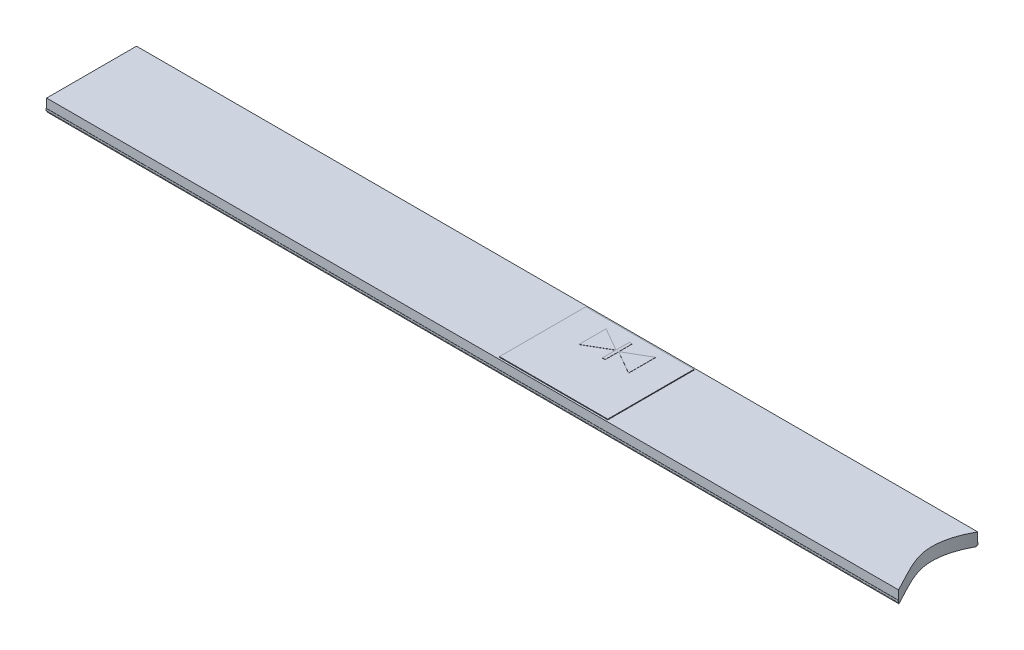
ISO-10303-21;
HEADER;
FILE_DESCRIPTION(('STEP AP214'),'2;1');
FILE_NAME('part.step','',(''),(''),'','','');
FILE_SCHEMA(('AUTOMOTIVE_DESIGN { 1 0 10303 214 1 1 1 1 }'));
ENDSEC;
DATA;
#1=APPLICATION_CONTEXT('core data for automotive mechanical design processes');
#2=APPLICATION_PROTOCOL_DEFINITION('international standard','automotive_design',2000,#1);
#3=PRODUCT_CONTEXT('',#1,'mechanical');
#4=PRODUCT('Part','Part','',(#3));
#5=PRODUCT_RELATED_PRODUCT_CATEGORY('part','',(#4));
#6=PRODUCT_DEFINITION_FORMATION('','',#4);
#7=PRODUCT_DEFINITION_CONTEXT('part definition',#1,'design');
#8=PRODUCT_DEFINITION('design','',#6,#7);
#9=PRODUCT_DEFINITION_SHAPE('','',#8);
#10=(LENGTH_UNIT() NAMED_UNIT(*) SI_UNIT(.MILLI.,.METRE.));
#11=(NAMED_UNIT(*) PLANE_ANGLE_UNIT() SI_UNIT($,.RADIAN.));
#12=(NAMED_UNIT(*) SI_UNIT($,.STERADIAN.) SOLID_ANGLE_UNIT());
#13=UNCERTAINTY_MEASURE_WITH_UNIT(LENGTH_MEASURE(1.E-05),#10,'distance_accuracy_value','');
#14=(GEOMETRIC_REPRESENTATION_CONTEXT(3) GLOBAL_UNCERTAINTY_ASSIGNED_CONTEXT((#13)) GLOBAL_UNIT_ASSIGNED_CONTEXT((#10,
#11,#12)) REPRESENTATION_CONTEXT('',''));
#15=CARTESIAN_POINT('',(0.,0.,0.));
#16=DIRECTION('',(0.,0.,1.));
#17=DIRECTION('',(1.,0.,0.));
#18=AXIS2_PLACEMENT_3D('',#15,#16,#17);
#19=CARTESIAN_POINT('',(50.05,1.38,-0.220000006957639));
#20=DIRECTION('',(0.,1.,0.));
#21=DIRECTION('',(0.,0.,1.));
#22=AXIS2_PLACEMENT_3D('',#19,#20,#21);
#23=PLANE('',#22);
#24=DIRECTION('',(0.,0.,1.));
#25=VECTOR('',#24,1.);
#26=CARTESIAN_POINT('',(50.05,1.38,-9.78000000000886));
#27=LINE('',#26,#25);
#28=CARTESIAN_POINT('',(50.05,1.38,-9.78000000000886));
#29=VERTEX_POINT('',#28);
#30=CARTESIAN_POINT('',(50.05,1.38,-0.220000006957639));
#31=VERTEX_POINT('',#30);
#32=EDGE_CURVE('E272',#29,#31,#27,.T.);
#33=ORIENTED_EDGE('',*,*,#32,.T.);
#34=DIRECTION('',(1.,0.,0.));
#35=VECTOR('',#34,1.);
#36=CARTESIAN_POINT('',(50.05,1.38,-0.220000006957639));
#37=LINE('',#36,#35);
#38=CARTESIAN_POINT('',(62.05,1.38,-0.220000006957639));
#39=VERTEX_POINT('',#38);
#40=EDGE_CURVE('E276',#31,#39,#37,.T.);
#41=ORIENTED_EDGE('',*,*,#40,.T.);
#42=DIRECTION('',(0.,0.,-1.));
#43=VECTOR('',#42,1.);
#44=CARTESIAN_POINT('',(62.05,1.38,-9.78000000000886));
#45=LINE('',#44,#43);
#46=CARTESIAN_POINT('',(62.05,1.38,-9.78000000000886));
#47=VERTEX_POINT('',#46);
#48=EDGE_CURVE('E280',#39,#47,#45,.T.);
#49=ORIENTED_EDGE('',*,*,#48,.T.);
#50=DIRECTION('',(-1.,0.,0.));
#51=VECTOR('',#50,1.);
#52=CARTESIAN_POINT('',(50.05,1.38,-9.78000000000886));
#53=LINE('',#52,#51);
#54=EDGE_CURVE('E283',#47,#29,#53,.T.);
#55=ORIENTED_EDGE('',*,*,#54,.T.);
#56=EDGE_LOOP('',(#33,#41,#49,#55));
#57=FACE_BOUND('',#56,.T.);
#58=DIRECTION('',(-0.866025403784439,0.,-0.5));
#59=VECTOR('',#58,1.);
#60=CARTESIAN_POINT('',(55.9,1.38,-7.28118403431081));
#61=LINE('',#60,#59);
#62=CARTESIAN_POINT('',(55.9,1.38,-7.28118403431081));
#63=VERTEX_POINT('',#62);
#64=CARTESIAN_POINT('',(53.3039745962156,1.38,-8.78000000000886));
#65=VERTEX_POINT('',#64);
#66=EDGE_CURVE('E722',#63,#65,#61,.T.);
#67=ORIENTED_EDGE('',*,*,#66,.F.);
#68=DIRECTION('',(0.,0.,1.));
#69=VECTOR('',#68,1.);
#70=CARTESIAN_POINT('',(55.9,1.38,-8.78000000000886));
#71=LINE('',#70,#69);
#72=CARTESIAN_POINT('',(55.9,1.38,-8.78000000000886));
#73=VERTEX_POINT('',#72);
#74=EDGE_CURVE('E257',#73,#63,#71,.T.);
#75=ORIENTED_EDGE('',*,*,#74,.F.);
#76=DIRECTION('',(-1.,0.,0.));
#77=VECTOR('',#76,1.);
#78=CARTESIAN_POINT('',(55.9,1.38,-8.78000000000886));
#79=LINE('',#78,#77);
#80=CARTESIAN_POINT('',(56.2,1.38,-8.78000000000886));
#81=VERTEX_POINT('',#80);
#82=EDGE_CURVE('E253',#81,#73,#79,.T.);
#83=ORIENTED_EDGE('',*,*,#82,.F.);
#84=DIRECTION('',(0.,0.,-1.));
#85=VECTOR('',#84,1.);
#86=CARTESIAN_POINT('',(56.2,1.38,-8.78000000000886));
#87=LINE('',#86,#85);
#88=CARTESIAN_POINT('',(56.2,1.38,-7.28118403431081));
#89=VERTEX_POINT('',#88);
#90=EDGE_CURVE('E717',#89,#81,#87,.T.);
#91=ORIENTED_EDGE('',*,*,#90,.F.);
#92=DIRECTION('',(-0.866025403784439,0.,0.5));
#93=VECTOR('',#92,1.);
#94=CARTESIAN_POINT('',(56.2,1.38,-7.28118403431081));
#95=LINE('',#94,#93);
#96=CARTESIAN_POINT('',(58.7960254037844,1.38,-8.78000000000886));
#97=VERTEX_POINT('',#96);
#98=EDGE_CURVE('E751',#97,#89,#95,.T.);
#99=ORIENTED_EDGE('',*,*,#98,.F.);
#100=DIRECTION('',(0.,0.,-1.));
#101=VECTOR('',#100,1.);
#102=CARTESIAN_POINT('',(58.7960254037844,1.38,-8.78000000000886));
#103=LINE('',#102,#101);
#104=CARTESIAN_POINT('',(58.7960254037844,1.38,-5.78000000000886));
#105=VERTEX_POINT('',#104);
#106=EDGE_CURVE('E748',#105,#97,#103,.T.);
#107=ORIENTED_EDGE('',*,*,#106,.F.);
#108=DIRECTION('',(0.866025403784439,0.,0.5));
#109=VECTOR('',#108,1.);
#110=CARTESIAN_POINT('',(58.7960254037844,1.38,-5.78000000000886));
#111=LINE('',#110,#109);
#112=CARTESIAN_POINT('',(56.2,1.38,-7.27881596570691));
#113=VERTEX_POINT('',#112);
#114=EDGE_CURVE('E745',#113,#105,#111,.T.);
#115=ORIENTED_EDGE('',*,*,#114,.F.);
#116=DIRECTION('',(0.,0.,-1.));
#117=VECTOR('',#116,1.);
#118=CARTESIAN_POINT('',(56.2,1.38,-7.27881596570691));
#119=LINE('',#118,#117);
#120=CARTESIAN_POINT('',(56.2,1.38,-5.78000000000886));
#121=VERTEX_POINT('',#120);
#122=EDGE_CURVE('E742',#121,#113,#119,.T.);
#123=ORIENTED_EDGE('',*,*,#122,.F.);
#124=DIRECTION('',(1.,0.,0.));
#125=VECTOR('',#124,1.);
#126=CARTESIAN_POINT('',(55.9,1.38,-5.78000000000886));
#127=LINE('',#126,#125);
#128=CARTESIAN_POINT('',(55.9,1.38,-5.78000000000886));
#129=VERTEX_POINT('',#128);
#130=EDGE_CURVE('E739',#129,#121,#127,.T.);
#131=ORIENTED_EDGE('',*,*,#130,.F.);
#132=DIRECTION('',(0.,0.,1.));
#133=VECTOR('',#132,1.);
#134=CARTESIAN_POINT('',(55.9,1.38,-7.27881596570692));
#135=LINE('',#134,#133);
#136=CARTESIAN_POINT('',(55.9,1.38,-7.27881596570692));
#137=VERTEX_POINT('',#136);
#138=EDGE_CURVE('E736',#137,#129,#135,.T.);
#139=ORIENTED_EDGE('',*,*,#138,.F.);
#140=DIRECTION('',(0.866025403784438,0.,-0.5));
#141=VECTOR('',#140,1.);
#142=CARTESIAN_POINT('',(53.3039745962156,1.38,-5.78000000000886));
#143=LINE('',#142,#141);
#144=CARTESIAN_POINT('',(53.3039745962156,1.38,-5.78000000000886));
#145=VERTEX_POINT('',#144);
#146=EDGE_CURVE('E733',#145,#137,#143,.T.);
#147=ORIENTED_EDGE('',*,*,#146,.F.);
#148=DIRECTION('',(0.,0.,1.));
#149=VECTOR('',#148,1.);
#150=CARTESIAN_POINT('',(53.3039745962156,1.38,-8.78000000000886));
#151=LINE('',#150,#149);
#152=EDGE_CURVE('E726',#65,#145,#151,.T.);
#153=ORIENTED_EDGE('',*,*,#152,.F.);
#154=EDGE_LOOP('',(#67,#75,#83,#91,#99,#107,#115,#123,#131,#139,#147,#153));
#155=FACE_BOUND('',#154,.T.);
#156=ADVANCED_FACE('F35',(#57,#155),#23,.T.);
#157=CARTESIAN_POINT('',(100.,1.3,-0.02));
#158=DIRECTION('',(0.,-1.,0.));
#159=DIRECTION('',(0.,0.,-1.));
#160=AXIS2_PLACEMENT_3D('',#157,#158,#159);
#161=PLANE('',#160);
#162=DIRECTION('',(-1.,0.,0.));
#163=VECTOR('',#162,1.);
#164=CARTESIAN_POINT('',(100.,1.3,-0.02));
#165=LINE('',#164,#163);
#166=CARTESIAN_POINT('',(94.4813840286868,1.3,-0.0200000069576393));
#167=VERTEX_POINT('',#166);
#168=CARTESIAN_POINT('',(0.05,1.3,-0.02));
#169=VERTEX_POINT('',#168);
#170=EDGE_CURVE('E945',#167,#169,#165,.T.);
#171=ORIENTED_EDGE('',*,*,#170,.F.);
#172=CARTESIAN_POINT('',(106.958570584329,1.3,-17.1821009492431));
#173=CARTESIAN_POINT('',(100.083371055669,1.3,-18.5938583080374));
#174=CARTESIAN_POINT('',(87.5504685425177,1.3,-7.82181495656971));
#175=CARTESIAN_POINT('',(98.8594167359777,1.3,3.79082974327303));
#176=CARTESIAN_POINT('',(86.8974112804466,1.3,25.6367125442653));
#177=CARTESIAN_POINT('',(120.943228088424,1.3,13.4277186627103));
#178=CARTESIAN_POINT('',(109.774353112615,1.3,0.100316480868152));
#179=CARTESIAN_POINT('',(117.385402067769,1.3,-8.88298668915562));
#180=CARTESIAN_POINT('',(111.370581590185,1.3,-16.2761361145304));
#181=CARTESIAN_POINT('',(106.958570584329,1.3,-17.1821009492431));
#182=B_SPLINE_CURVE_WITH_KNOTS('',3,(#172,#173,#174,#175,#176,#177,#178,#179,#180,#181),
.UNSPECIFIED.,.T.,.F.,(4,1,1,1,1,1,1,4),(0.,0.200977252608359,0.292151963918186,
0.455467007185675,0.683077899943606,0.789929557939063,0.871027183031058,1.),.UNSPECIFIED.);
#183=CARTESIAN_POINT('',(93.2974374688703,1.3,-9.98000000000886));
#184=VERTEX_POINT('',#183);
#185=EDGE_CURVE('E310',#184,#167,#182,.T.);
#186=ORIENTED_EDGE('',*,*,#185,.F.);
#187=DIRECTION('',(-1.,0.,0.));
#188=VECTOR('',#187,1.);
#189=CARTESIAN_POINT('',(100.,1.3,-9.98));
#190=LINE('',#189,#188);
#191=CARTESIAN_POINT('',(0.05,1.3,-9.98));
#192=VERTEX_POINT('',#191);
#193=EDGE_CURVE('E948',#184,#192,#190,.T.);
#194=ORIENTED_EDGE('',*,*,#193,.T.);
#195=DIRECTION('',(0.,0.,1.));
#196=VECTOR('',#195,1.);
#197=CARTESIAN_POINT('',(0.05,1.3,-0.02));
#198=LINE('',#197,#196);
#199=EDGE_CURVE('E880',#192,#169,#198,.T.);
#200=ORIENTED_EDGE('',*,*,#199,.T.);
#201=EDGE_LOOP('',(#171,#186,#194,#200));
#202=FACE_BOUND('',#201,.T.);
#203=DIRECTION('',(0.,0.,1.));
#204=VECTOR('',#203,1.);
#205=CARTESIAN_POINT('',(50.05,1.3,-9.78000000000886));
#206=LINE('',#205,#204);
#207=CARTESIAN_POINT('',(50.05,1.3,-9.78000000000886));
#208=VERTEX_POINT('',#207);
#209=CARTESIAN_POINT('',(50.05,1.3,-0.220000006957639));
#210=VERTEX_POINT('',#209);
#211=EDGE_CURVE('E260',#208,#210,#206,.T.);
#212=ORIENTED_EDGE('',*,*,#211,.F.);
#213=DIRECTION('',(-1.,0.,0.));
#214=VECTOR('',#213,1.);
#215=CARTESIAN_POINT('',(50.05,1.3,-9.78000000000886));
#216=LINE('',#215,#214);
#217=CARTESIAN_POINT('',(62.05,1.3,-9.78000000000886));
#218=VERTEX_POINT('',#217);
#219=EDGE_CURVE('E277',#218,#208,#216,.T.);
#220=ORIENTED_EDGE('',*,*,#219,.F.);
#221=DIRECTION('',(0.,0.,-1.));
#222=VECTOR('',#221,1.);
#223=CARTESIAN_POINT('',(62.05,1.3,-9.78000000000886));
#224=LINE('',#223,#222);
#225=CARTESIAN_POINT('',(62.05,1.3,-0.220000006957639));
#226=VERTEX_POINT('',#225);
#227=EDGE_CURVE('E289',#226,#218,#224,.T.);
#228=ORIENTED_EDGE('',*,*,#227,.F.);
#229=DIRECTION('',(1.,0.,0.));
#230=VECTOR('',#229,1.);
#231=CARTESIAN_POINT('',(50.05,1.3,-0.220000006957639));
#232=LINE('',#231,#230);
#233=EDGE_CURVE('E64',#210,#226,#232,.T.);
#234=ORIENTED_EDGE('',*,*,#233,.F.);
#235=EDGE_LOOP('',(#212,#220,#228,#234));
#236=FACE_BOUND('',#235,.T.);
#237=ADVANCED_FACE('F367',(#202,#236),#161,.F.);
#238=CARTESIAN_POINT('',(0.,0.1,-0.1));
#239=DIRECTION('',(1.,0.,0.));
#240=DIRECTION('',(0.,0.,-1.));
#241=AXIS2_PLACEMENT_3D('',#238,#239,#240);
#242=PLANE('',#241);
#243=DIRECTION('',(0.,0.,1.));
#244=VECTOR('',#243,1.);
#245=CARTESIAN_POINT('',(0.,0.,-9.9));
#246=LINE('',#245,#244);
#247=CARTESIAN_POINT('',(0.,0.,-9.9));
#248=VERTEX_POINT('',#247);
#249=CARTESIAN_POINT('',(0.,0.,-0.100000000000001));
#250=VERTEX_POINT('',#249);
#251=EDGE_CURVE('E826',#248,#250,#246,.T.);
#252=ORIENTED_EDGE('',*,*,#251,.T.);
#253=CARTESIAN_POINT('',(0.,0.1,-0.1));
#254=DIRECTION('',(1.,0.,0.));
#255=DIRECTION('',(0.,0.,-1.));
#256=AXIS2_PLACEMENT_3D('',#253,#254,#255);
#257=CIRCLE('',#256,0.1);
#258=CARTESIAN_POINT('',(0.,0.100000000000001,0.));
#259=VERTEX_POINT('',#258);
#260=EDGE_CURVE('E841',#259,#250,#257,.T.);
#261=ORIENTED_EDGE('',*,*,#260,.F.);
#262=DIRECTION('',(0.,-1.,0.));
#263=VECTOR('',#262,1.);
#264=CARTESIAN_POINT('',(0.,0.100000000000001,0.));
#265=LINE('',#264,#263);
#266=CARTESIAN_POINT('',(0.,0.3,0.));
#267=VERTEX_POINT('',#266);
#268=EDGE_CURVE('E923',#267,#259,#265,.T.);
#269=ORIENTED_EDGE('',*,*,#268,.F.);
#270=DIRECTION('',(0.,0.,1.));
#271=VECTOR('',#270,1.);
#272=CARTESIAN_POINT('',(0.,0.3,0.));
#273=LINE('',#272,#271);
#274=CARTESIAN_POINT('',(0.,0.3,-10.));
#275=VERTEX_POINT('',#274);
#276=EDGE_CURVE('E919',#275,#267,#273,.T.);
#277=ORIENTED_EDGE('',*,*,#276,.F.);
#278=DIRECTION('',(0.,1.,0.));
#279=VECTOR('',#278,1.);
#280=CARTESIAN_POINT('',(0.,0.100000000000001,-10.));
#281=LINE('',#280,#279);
#282=CARTESIAN_POINT('',(0.,0.100000000000001,-10.));
#283=VERTEX_POINT('',#282);
#284=EDGE_CURVE('E882',#283,#275,#281,.T.);
#285=ORIENTED_EDGE('',*,*,#284,.F.);
#286=CARTESIAN_POINT('',(0.,0.1,-9.9));
#287=DIRECTION('',(1.,0.,0.));
#288=DIRECTION('',(0.,0.,1.));
#289=AXIS2_PLACEMENT_3D('',#286,#287,#288);
#290=CIRCLE('',#289,0.0999999999999997);
#291=EDGE_CURVE('E838',#248,#283,#290,.T.);
#292=ORIENTED_EDGE('',*,*,#291,.F.);
#293=EDGE_LOOP('',(#252,#261,#269,#277,#285,#292));
#294=FACE_BOUND('',#293,.T.);
#295=ADVANCED_FACE('F369',(#294),#242,.F.);
#296=CARTESIAN_POINT('',(100.,0.3,-9.98));
#297=DIRECTION('',(0.,0.,1.));
#298=DIRECTION('',(1.,0.,0.));
#299=AXIS2_PLACEMENT_3D('',#296,#297,#298);
#300=PLANE('',#299);
#301=ORIENTED_EDGE('',*,*,#193,.F.);
#302=DIRECTION('',(0.,1.,0.));
#303=VECTOR('',#302,1.);
#304=CARTESIAN_POINT('',(93.2974374688653,-0.7,-9.98));
#305=LINE('',#304,#303);
#306=CARTESIAN_POINT('',(93.2974374688703,0.3,-9.98000000000885));
#307=VERTEX_POINT('',#306);
#308=EDGE_CURVE('E829',#184,#307,#305,.F.);
#309=ORIENTED_EDGE('',*,*,#308,.T.);
#310=DIRECTION('',(-1.,0.,0.));
#311=VECTOR('',#310,1.);
#312=CARTESIAN_POINT('',(100.,0.3,-9.98));
#313=LINE('',#312,#311);
#314=CARTESIAN_POINT('',(0.05,0.3,-9.98));
#315=VERTEX_POINT('',#314);
#316=EDGE_CURVE('E951',#307,#315,#313,.T.);
#317=ORIENTED_EDGE('',*,*,#316,.T.);
#318=DIRECTION('',(0.,1.,0.));
#319=VECTOR('',#318,1.);
#320=CARTESIAN_POINT('',(0.05,0.3,-9.98));
#321=LINE('',#320,#319);
#322=EDGE_CURVE('E872',#315,#192,#321,.T.);
#323=ORIENTED_EDGE('',*,*,#322,.T.);
#324=EDGE_LOOP('',(#301,#309,#317,#323));
#325=FACE_BOUND('',#324,.T.);
#326=ADVANCED_FACE('F365',(#325),#300,.F.);
#327=CARTESIAN_POINT('',(100.,0.3,-0.02));
#328=DIRECTION('',(0.,0.,-1.));
#329=DIRECTION('',(0.,1.,0.));
#330=AXIS2_PLACEMENT_3D('',#327,#328,#329);
#331=PLANE('',#330);
#332=DIRECTION('',(-1.,0.,0.));
#333=VECTOR('',#332,1.);
#334=CARTESIAN_POINT('',(100.,0.3,-0.02));
#335=LINE('',#334,#333);
#336=CARTESIAN_POINT('',(94.4813840286868,0.3,-0.0200000069576393));
#337=VERTEX_POINT('',#336);
#338=CARTESIAN_POINT('',(0.05,0.3,-0.02));
#339=VERTEX_POINT('',#338);
#340=EDGE_CURVE('E942',#337,#339,#335,.T.);
#341=ORIENTED_EDGE('',*,*,#340,.F.);
#342=DIRECTION('',(0.,1.,0.));
#343=VECTOR('',#342,1.);
#344=CARTESIAN_POINT('',(94.4813840321051,-0.7,-0.019999999999999));
#345=LINE('',#344,#343);
#346=EDGE_CURVE('E859',#337,#167,#345,.T.);
#347=ORIENTED_EDGE('',*,*,#346,.T.);
#348=ORIENTED_EDGE('',*,*,#170,.T.);
#349=DIRECTION('',(0.,-1.,0.));
#350=VECTOR('',#349,1.);
#351=CARTESIAN_POINT('',(0.05,0.3,-0.02));
#352=LINE('',#351,#350);
#353=EDGE_CURVE('E847',#169,#339,#352,.T.);
#354=ORIENTED_EDGE('',*,*,#353,.T.);
#355=EDGE_LOOP('',(#341,#347,#348,#354));
#356=FACE_BOUND('',#355,.T.);
#357=ADVANCED_FACE('F362',(#356),#331,.F.);
#358=CARTESIAN_POINT('',(100.,0.100000000000001,-10.));
#359=DIRECTION('',(0.,0.,1.));
#360=DIRECTION('',(1.,0.,0.));
#361=AXIS2_PLACEMENT_3D('',#358,#359,#360);
#362=PLANE('',#361);
#363=DIRECTION('',(-1.,0.,0.));
#364=VECTOR('',#363,1.);
#365=CARTESIAN_POINT('',(100.,0.3,-10.));
#366=LINE('',#365,#364);
#367=CARTESIAN_POINT('',(93.3086581902393,0.3,-10.));
#368=VERTEX_POINT('',#367);
#369=EDGE_CURVE('E49',#368,#275,#366,.T.);
#370=ORIENTED_EDGE('',*,*,#369,.F.);
#371=DIRECTION('',(0.,1.,0.));
#372=VECTOR('',#371,1.);
#373=CARTESIAN_POINT('',(93.3086581902393,-0.7,-10.));
#374=LINE('',#373,#372);
#375=CARTESIAN_POINT('',(93.3086581902393,0.100000000000001,-10.));
#376=VERTEX_POINT('',#375);
#377=EDGE_CURVE('E856',#368,#376,#374,.F.);
#378=ORIENTED_EDGE('',*,*,#377,.T.);
#379=DIRECTION('',(-1.,0.,0.));
#380=VECTOR('',#379,1.);
#381=CARTESIAN_POINT('',(100.,0.100000000000001,-10.));
#382=LINE('',#381,#380);
#383=EDGE_CURVE('E840',#376,#283,#382,.T.);
#384=ORIENTED_EDGE('',*,*,#383,.T.);
#385=ORIENTED_EDGE('',*,*,#284,.T.);
#386=EDGE_LOOP('',(#370,#378,#384,#385));
#387=FACE_BOUND('',#386,.T.);
#388=ADVANCED_FACE('F37',(#387),#362,.F.);
#389=CARTESIAN_POINT('',(100.,0.3,0.));
#390=DIRECTION('',(0.,-1.,0.));
#391=DIRECTION('',(0.,0.,-1.));
#392=AXIS2_PLACEMENT_3D('',#389,#390,#391);
#393=PLANE('',#392);
#394=DIRECTION('',(-1.,0.,0.));
#395=VECTOR('',#394,1.);
#396=CARTESIAN_POINT('',(100.,0.3,0.));
#397=LINE('',#396,#395);
#398=CARTESIAN_POINT('',(94.4911971587422,0.3,0.));
#399=VERTEX_POINT('',#398);
#400=EDGE_CURVE('E939',#399,#267,#397,.T.);
#401=ORIENTED_EDGE('',*,*,#400,.F.);
#402=CARTESIAN_POINT('',(106.958570584329,0.3,-17.1821009492431));
#403=CARTESIAN_POINT('',(100.083371055669,0.3,-18.5938583080374));
#404=CARTESIAN_POINT('',(87.5504685425177,0.3,-7.82181495656971));
#405=CARTESIAN_POINT('',(98.8594167359777,0.3,3.79082974327303));
#406=CARTESIAN_POINT('',(86.8974112804466,0.3,25.6367125442653));
#407=CARTESIAN_POINT('',(120.943228088424,0.3,13.4277186627103));
#408=CARTESIAN_POINT('',(109.774353112615,0.3,0.100316480868152));
#409=CARTESIAN_POINT('',(117.385402067769,0.3,-8.88298668915562));
#410=CARTESIAN_POINT('',(111.370581590185,0.3,-16.2761361145304));
#411=CARTESIAN_POINT('',(106.958570584329,0.3,-17.1821009492431));
#412=B_SPLINE_CURVE_WITH_KNOTS('',3,(#402,#403,#404,#405,#406,#407,#408,#409,#410,#411),
.UNSPECIFIED.,.T.,.F.,(4,1,1,1,1,1,1,4),(0.,0.200977252608359,0.292151963918186,
0.455467007185675,0.683077899943606,0.789929557939063,0.871027183031058,1.),.UNSPECIFIED.);
#413=EDGE_CURVE('E853',#399,#337,#412,.F.);
#414=ORIENTED_EDGE('',*,*,#413,.T.);
#415=ORIENTED_EDGE('',*,*,#340,.T.);
#416=DIRECTION('',(0.,0.,-1.));
#417=VECTOR('',#416,1.);
#418=CARTESIAN_POINT('',(0.05,0.3,-0.02));
#419=LINE('',#418,#417);
#420=EDGE_CURVE('E869',#339,#315,#419,.T.);
#421=ORIENTED_EDGE('',*,*,#420,.T.);
#422=ORIENTED_EDGE('',*,*,#316,.F.);
#423=EDGE_CURVE('E857',#307,#368,#412,.F.);
#424=ORIENTED_EDGE('',*,*,#423,.T.);
#425=ORIENTED_EDGE('',*,*,#369,.T.);
#426=ORIENTED_EDGE('',*,*,#276,.T.);
#427=EDGE_LOOP('',(#401,#414,#415,#421,#422,#424,#425,#426));
#428=FACE_BOUND('',#427,.T.);
#429=ADVANCED_FACE('F357',(#428),#393,.F.);
#430=CARTESIAN_POINT('',(100.,0.100000000000001,0.));
#431=DIRECTION('',(0.,0.,-1.));
#432=DIRECTION('',(-1.,0.,0.));
#433=AXIS2_PLACEMENT_3D('',#430,#431,#432);
#434=PLANE('',#433);
#435=DIRECTION('',(-1.,0.,0.));
#436=VECTOR('',#435,1.);
#437=CARTESIAN_POINT('',(100.,0.100000000000001,0.));
#438=LINE('',#437,#436);
#439=CARTESIAN_POINT('',(94.4911971587422,0.100000000000001,0.));
#440=VERTEX_POINT('',#439);
#441=EDGE_CURVE('E936',#440,#259,#438,.T.);
#442=ORIENTED_EDGE('',*,*,#441,.F.);
#443=DIRECTION('',(0.,1.,0.));
#444=VECTOR('',#443,1.);
#445=CARTESIAN_POINT('',(94.4911971587422,-0.7,0.));
#446=LINE('',#445,#444);
#447=EDGE_CURVE('E342',#440,#399,#446,.T.);
#448=ORIENTED_EDGE('',*,*,#447,.T.);
#449=ORIENTED_EDGE('',*,*,#400,.T.);
#450=ORIENTED_EDGE('',*,*,#268,.T.);
#451=EDGE_LOOP('',(#442,#448,#449,#450));
#452=FACE_BOUND('',#451,.T.);
#453=ADVANCED_FACE('F352',(#452),#434,.F.);
#454=CARTESIAN_POINT('',(100.,0.1,-0.1));
#455=DIRECTION('',(-1.,0.,0.));
#456=DIRECTION('',(0.,0.,1.));
#457=AXIS2_PLACEMENT_3D('',#454,#455,#456);
#458=CYLINDRICAL_SURFACE('',#457,0.1);
#459=DIRECTION('',(-1.,0.,0.));
#460=VECTOR('',#459,1.);
#461=CARTESIAN_POINT('',(100.,0.,-0.100000000000001));
#462=LINE('',#461,#460);
#463=CARTESIAN_POINT('',(94.4418771322431,0.,-0.0999999999999943));
#464=VERTEX_POINT('',#463);
#465=CARTESIAN_POINT('',(0.05,0.,-0.100000000000001));
#466=VERTEX_POINT('',#465);
#467=EDGE_CURVE('E864',#464,#466,#462,.T.);
#468=ORIENTED_EDGE('',*,*,#467,.F.);
#469=CARTESIAN_POINT('',(94.4418771322431,0.,-0.1));
#470=CARTESIAN_POINT('',(94.4449230230465,3.33196420924365E-06,-0.0938632472451509));
#471=CARTESIAN_POINT('',(94.4479608150487,0.00056599998699437,-0.0877355403600656));
#472=CARTESIAN_POINT('',(94.4539568471465,0.00281835347457442,-0.0756271893705428));
#473=CARTESIAN_POINT('',(94.4569148090137,0.00451155494992549,-0.0696470646082057));
#474=CARTESIAN_POINT('',(94.4655271035233,0.0112806722933578,-0.0522160867909083));
#475=CARTESIAN_POINT('',(94.4709391147774,0.0180460619468469,-0.0412357897000676));
#476=CARTESIAN_POINT('',(94.4799539676735,0.0351681621844633,-0.0229155037333773));
#477=CARTESIAN_POINT('',(94.4836512504027,0.045264020599166,-0.0153858654016094));
#478=CARTESIAN_POINT('',(94.4875249509752,0.06160402458568,-0.00749086329053427));
#479=CARTESIAN_POINT('',(94.48851817223,0.0668962857957108,-0.0054654117103842));
#480=CARTESIAN_POINT('',(94.4900544864048,0.0778038365012901,-0.00233176479591595));
#481=CARTESIAN_POINT('',(94.490598578507,0.0834183790652433,-0.0012215333696532));
#482=CARTESIAN_POINT('',(94.4911002115676,0.0927138180952262,-0.000197837019780981));
#483=CARTESIAN_POINT('',(94.4911988805906,0.0963578710854954,3.56518329193587E-06));
#484=CARTESIAN_POINT('',(94.4911971587422,0.1,0.));
#485=B_SPLINE_CURVE_WITH_KNOTS('',3,(#469,#470,#471,#472,#473,#474,#475,#476,#477,#478,#479,
#480,#481,#482,#483,#484),.UNSPECIFIED.,.F.,.F.,(4,2,2,2,2,2,2,4),(0.,0.0205055198249933,
0.0410751116581753,0.0820904974406317,0.120450597700277,0.137626557267639,0.154764201530694,
0.165689416045344),.UNSPECIFIED.);
#486=EDGE_CURVE('E333',#464,#440,#485,.T.);
#487=ORIENTED_EDGE('',*,*,#486,.T.);
#488=ORIENTED_EDGE('',*,*,#441,.T.);
#489=ORIENTED_EDGE('',*,*,#260,.T.);
#490=DIRECTION('',(-1.,0.,0.));
#491=VECTOR('',#490,1.);
#492=CARTESIAN_POINT('',(0.05,0.,-0.100000000000001));
#493=LINE('',#492,#491);
#494=EDGE_CURVE('E848',#466,#250,#493,.T.);
#495=ORIENTED_EDGE('',*,*,#494,.F.);
#496=EDGE_LOOP('',(#468,#487,#488,#489,#495));
#497=FACE_BOUND('',#496,.T.);
#498=ADVANCED_FACE('F346',(#497),#458,.T.);
#499=CARTESIAN_POINT('',(100.,0.,-0.100000000000001));
#500=DIRECTION('',(0.,0.,-1.));
#501=DIRECTION('',(0.,1.,0.));
#502=AXIS2_PLACEMENT_3D('',#499,#500,#501);
#503=PLANE('',#502);
#504=DIRECTION('',(-1.,0.,0.));
#505=VECTOR('',#504,1.);
#506=CARTESIAN_POINT('',(100.,-0.1,-0.1));
#507=LINE('',#506,#505);
#508=CARTESIAN_POINT('',(94.4418771268718,-0.1,-0.100000010822156));
#509=VERTEX_POINT('',#508);
#510=CARTESIAN_POINT('',(0.05,-0.1,-0.100000000000001));
#511=VERTEX_POINT('',#510);
#512=EDGE_CURVE('E862',#509,#511,#507,.T.);
#513=ORIENTED_EDGE('',*,*,#512,.F.);
#514=DIRECTION('',(0.,1.,0.));
#515=VECTOR('',#514,1.);
#516=CARTESIAN_POINT('',(94.4418771322431,-0.7,-0.0999999999999943));
#517=LINE('',#516,#515);
#518=EDGE_CURVE('E343',#509,#464,#517,.T.);
#519=ORIENTED_EDGE('',*,*,#518,.T.);
#520=ORIENTED_EDGE('',*,*,#467,.T.);
#521=DIRECTION('',(0.,-1.,0.));
#522=VECTOR('',#521,1.);
#523=CARTESIAN_POINT('',(0.05,-0.1,-0.100000000000001));
#524=LINE('',#523,#522);
#525=EDGE_CURVE('E906',#466,#511,#524,.T.);
#526=ORIENTED_EDGE('',*,*,#525,.T.);
#527=EDGE_LOOP('',(#513,#519,#520,#526));
#528=FACE_BOUND('',#527,.T.);
#529=ADVANCED_FACE('F351',(#528),#503,.F.);
#530=CARTESIAN_POINT('',(100.,-0.1,-0.1));
#531=DIRECTION('',(0.,1.,0.));
#532=DIRECTION('',(0.,0.,1.));
#533=AXIS2_PLACEMENT_3D('',#530,#531,#532);
#534=PLANE('',#533);
#535=DIRECTION('',(-1.,0.,0.));
#536=VECTOR('',#535,1.);
#537=CARTESIAN_POINT('',(100.,-0.1,-9.9));
#538=LINE('',#537,#536);
#539=CARTESIAN_POINT('',(93.2530892525262,-0.1,-9.90000000000001));
#540=VERTEX_POINT('',#539);
#541=CARTESIAN_POINT('',(0.05,-0.1,-9.9));
#542=VERTEX_POINT('',#541);
#543=EDGE_CURVE('E865',#540,#542,#538,.T.);
#544=ORIENTED_EDGE('',*,*,#543,.F.);
#545=CARTESIAN_POINT('',(106.958570584329,-0.1,-17.1821009492431));
#546=CARTESIAN_POINT('',(100.083371055669,-0.1,-18.5938583080374));
#547=CARTESIAN_POINT('',(87.5504685425177,-0.1,-7.82181495656971));
#548=CARTESIAN_POINT('',(98.8594167359777,-0.1,3.79082974327303));
#549=CARTESIAN_POINT('',(86.8974112804466,-0.1,25.6367125442653));
#550=CARTESIAN_POINT('',(120.943228088424,-0.1,13.4277186627103));
#551=CARTESIAN_POINT('',(109.774353112615,-0.1,0.100316480868152));
#552=CARTESIAN_POINT('',(117.385402067769,-0.1,-8.88298668915562));
#553=CARTESIAN_POINT('',(111.370581590185,-0.1,-16.2761361145304));
#554=CARTESIAN_POINT('',(106.958570584329,-0.1,-17.1821009492431));
#555=B_SPLINE_CURVE_WITH_KNOTS('',3,(#545,#546,#547,#548,#549,#550,#551,#552,#553,#554),
.UNSPECIFIED.,.T.,.F.,(4,1,1,1,1,1,1,4),(0.,0.200977252608359,0.292151963918186,
0.455467007185675,0.683077899943606,0.789929557939063,0.871027183031058,1.),.UNSPECIFIED.);
#556=EDGE_CURVE('E834',#540,#509,#555,.T.);
#557=ORIENTED_EDGE('',*,*,#556,.T.);
#558=ORIENTED_EDGE('',*,*,#512,.T.);
#559=DIRECTION('',(0.,0.,-1.));
#560=VECTOR('',#559,1.);
#561=CARTESIAN_POINT('',(0.05,-0.1,-9.9));
#562=LINE('',#561,#560);
#563=EDGE_CURVE('E851',#511,#542,#562,.T.);
#564=ORIENTED_EDGE('',*,*,#563,.T.);
#565=EDGE_LOOP('',(#544,#557,#558,#564));
#566=FACE_BOUND('',#565,.T.);
#567=ADVANCED_FACE('F444',(#566),#534,.F.);
#568=CARTESIAN_POINT('',(100.,0.,-9.9));
#569=DIRECTION('',(0.,0.,1.));
#570=DIRECTION('',(0.,-1.,0.));
#571=AXIS2_PLACEMENT_3D('',#568,#569,#570);
#572=PLANE('',#571);
#573=DIRECTION('',(-1.,0.,0.));
#574=VECTOR('',#573,1.);
#575=CARTESIAN_POINT('',(100.,0.,-9.9));
#576=LINE('',#575,#574);
#577=CARTESIAN_POINT('',(93.2530892525262,0.,-9.9));
#578=VERTEX_POINT('',#577);
#579=CARTESIAN_POINT('',(0.05,0.,-9.9));
#580=VERTEX_POINT('',#579);
#581=EDGE_CURVE('E875',#578,#580,#576,.T.);
#582=ORIENTED_EDGE('',*,*,#581,.F.);
#583=DIRECTION('',(0.,1.,0.));
#584=VECTOR('',#583,1.);
#585=CARTESIAN_POINT('',(93.2530892525262,-0.7,-9.90000000000001));
#586=LINE('',#585,#584);
#587=EDGE_CURVE('E837',#578,#540,#586,.F.);
#588=ORIENTED_EDGE('',*,*,#587,.T.);
#589=ORIENTED_EDGE('',*,*,#543,.T.);
#590=DIRECTION('',(0.,1.,0.));
#591=VECTOR('',#590,1.);
#592=CARTESIAN_POINT('',(0.05,-0.1,-9.9));
#593=LINE('',#592,#591);
#594=EDGE_CURVE('E828',#542,#580,#593,.T.);
#595=ORIENTED_EDGE('',*,*,#594,.T.);
#596=EDGE_LOOP('',(#582,#588,#589,#595));
#597=FACE_BOUND('',#596,.T.);
#598=ADVANCED_FACE('F438',(#597),#572,.F.);
#599=CARTESIAN_POINT('',(100.,0.1,-9.9));
#600=DIRECTION('',(-1.,0.,0.));
#601=DIRECTION('',(0.,0.,1.));
#602=AXIS2_PLACEMENT_3D('',#599,#600,#601);
#603=CYLINDRICAL_SURFACE('',#602,0.0999999999999997);
#604=ORIENTED_EDGE('',*,*,#383,.F.);
#605=CARTESIAN_POINT('',(93.3086581902393,0.100000000000001,-10.));
#606=CARTESIAN_POINT('',(93.3086600663123,0.0948821289967834,-10.0000031356279));
#607=CARTESIAN_POINT('',(93.3084368566831,0.0897754475393083,-9.99960643264201));
#608=CARTESIAN_POINT('',(93.3075652428897,0.0797372161448797,-9.99805621806409));
#609=CARTESIAN_POINT('',(93.3069186424288,0.0748050164238577,-9.99690591689373));
#610=CARTESIAN_POINT('',(93.3043840464472,0.060466469751071,-9.99239398862748));
#611=CARTESIAN_POINT('',(93.3019009164752,0.0514795748329706,-9.98797075298469));
#612=CARTESIAN_POINT('',(93.2956058138308,0.0350568326958301,-9.97673009023861));
#613=CARTESIAN_POINT('',(93.2917320779987,0.0277245007044637,-9.96980124981316));
#614=CARTESIAN_POINT('',(93.2826556626476,0.0148122750162976,-9.95351441959251));
#615=CARTESIAN_POINT('',(93.277348312245,0.0095571374908972,-9.94396282426066));
#616=CARTESIAN_POINT('',(93.265734816182,0.00197769143582865,-9.92298517635514));
#617=CARTESIAN_POINT('',(93.2593816829817,-2.74968963270605E-05,-9.91146738419581));
#618=CARTESIAN_POINT('',(93.2530892525262,0.,-9.90000000000001));
#619=B_SPLINE_CURVE_WITH_KNOTS('',3,(#605,#606,#607,#608,#609,#610,#611,#612,#613,#614,#615,
#616,#617,#618),.UNSPECIFIED.,.F.,.F.,(4,2,2,2,2,2,4),(0.,0.0153132868257835,0.0305617576937892,
0.0609487776373507,0.0928982841199766,0.128762070335309,0.167971291824284),.UNSPECIFIED.);
#620=EDGE_CURVE('E11',#376,#578,#619,.T.);
#621=ORIENTED_EDGE('',*,*,#620,.T.);
#622=ORIENTED_EDGE('',*,*,#581,.T.);
#623=DIRECTION('',(-1.,0.,0.));
#624=VECTOR('',#623,1.);
#625=CARTESIAN_POINT('',(0.05,0.,-9.9));
#626=LINE('',#625,#624);
#627=EDGE_CURVE('E844',#580,#248,#626,.T.);
#628=ORIENTED_EDGE('',*,*,#627,.T.);
#629=ORIENTED_EDGE('',*,*,#291,.T.);
#630=EDGE_LOOP('',(#604,#621,#622,#628,#629));
#631=FACE_BOUND('',#630,.T.);
#632=ADVANCED_FACE('F431',(#631),#603,.T.);
#633=CARTESIAN_POINT('',(0.05,1.3,-0.02));
#634=DIRECTION('',(-1.,0.,0.));
#635=DIRECTION('',(0.,0.,1.));
#636=AXIS2_PLACEMENT_3D('',#633,#634,#635);
#637=PLANE('',#636);
#638=ORIENTED_EDGE('',*,*,#353,.F.);
#639=ORIENTED_EDGE('',*,*,#199,.F.);
#640=ORIENTED_EDGE('',*,*,#322,.F.);
#641=ORIENTED_EDGE('',*,*,#420,.F.);
#642=EDGE_LOOP('',(#638,#639,#640,#641));
#643=FACE_BOUND('',#642,.T.);
#644=ADVANCED_FACE('F425',(#643),#637,.T.);
#645=CARTESIAN_POINT('',(0.05,0.,-9.9));
#646=DIRECTION('',(0.,-1.,0.));
#647=DIRECTION('',(0.,0.,-1.));
#648=AXIS2_PLACEMENT_3D('',#645,#646,#647);
#649=PLANE('',#648);
#650=ORIENTED_EDGE('',*,*,#251,.F.);
#651=ORIENTED_EDGE('',*,*,#627,.F.);
#652=DIRECTION('',(0.,0.,1.));
#653=VECTOR('',#652,1.);
#654=CARTESIAN_POINT('',(0.05,0.,-9.9));
#655=LINE('',#654,#653);
#656=EDGE_CURVE('E902',#580,#466,#655,.T.);
#657=ORIENTED_EDGE('',*,*,#656,.T.);
#658=ORIENTED_EDGE('',*,*,#494,.T.);
#659=EDGE_LOOP('',(#650,#651,#657,#658));
#660=FACE_BOUND('',#659,.T.);
#661=ADVANCED_FACE('F419',(#660),#649,.T.);
#662=CARTESIAN_POINT('',(0.05,0.,-9.9));
#663=DIRECTION('',(1.,0.,0.));
#664=DIRECTION('',(0.,0.,-1.));
#665=AXIS2_PLACEMENT_3D('',#662,#663,#664);
#666=PLANE('',#665);
#667=ORIENTED_EDGE('',*,*,#594,.F.);
#668=ORIENTED_EDGE('',*,*,#563,.F.);
#669=ORIENTED_EDGE('',*,*,#525,.F.);
#670=ORIENTED_EDGE('',*,*,#656,.F.);
#671=EDGE_LOOP('',(#667,#668,#669,#670));
#672=FACE_BOUND('',#671,.T.);
#673=ADVANCED_FACE('F327',(#672),#666,.F.);
#674=CARTESIAN_POINT('',(106.958570584329,-0.7,-17.1821009492431));
#675=CARTESIAN_POINT('',(100.083371055669,-0.7,-18.5938583080374));
#676=CARTESIAN_POINT('',(87.5504685425177,-0.7,-7.82181495656971));
#677=CARTESIAN_POINT('',(98.8594167359777,-0.7,3.79082974327303));
#678=CARTESIAN_POINT('',(86.8974112804466,-0.7,25.6367125442653));
#679=CARTESIAN_POINT('',(120.943228088424,-0.7,13.4277186627103));
#680=CARTESIAN_POINT('',(109.774353112615,-0.7,0.100316480868152));
#681=CARTESIAN_POINT('',(117.385402067769,-0.7,-8.88298668915562));
#682=CARTESIAN_POINT('',(111.370581590185,-0.7,-16.2761361145304));
#683=CARTESIAN_POINT('',(106.958570584329,-0.7,-17.1821009492431));
#684=B_SPLINE_CURVE_WITH_KNOTS('',3,(#674,#675,#676,#677,#678,#679,#680,#681,#682,#683),
.UNSPECIFIED.,.T.,.F.,(4,1,1,1,1,1,1,4),(0.,0.200977252608359,0.292151963918186,
0.455467007185675,0.683077899943606,0.789929557939063,0.871027183031058,1.),.UNSPECIFIED.);
#685=DIRECTION('',(0.,1.,0.));
#686=VECTOR('',#685,1.);
#687=SURFACE_OF_LINEAR_EXTRUSION('',#684,#686);
#688=ORIENTED_EDGE('',*,*,#185,.T.);
#689=ORIENTED_EDGE('',*,*,#346,.F.);
#690=ORIENTED_EDGE('',*,*,#413,.F.);
#691=ORIENTED_EDGE('',*,*,#447,.F.);
#692=ORIENTED_EDGE('',*,*,#486,.F.);
#693=ORIENTED_EDGE('',*,*,#518,.F.);
#694=ORIENTED_EDGE('',*,*,#556,.F.);
#695=ORIENTED_EDGE('',*,*,#587,.F.);
#696=ORIENTED_EDGE('',*,*,#620,.F.);
#697=ORIENTED_EDGE('',*,*,#377,.F.);
#698=ORIENTED_EDGE('',*,*,#423,.F.);
#699=ORIENTED_EDGE('',*,*,#308,.F.);
#700=EDGE_LOOP('',(#688,#689,#690,#691,#692,#693,#694,#695,#696,#697,#698,#699));
#701=FACE_BOUND('',#700,.T.);
#702=ADVANCED_FACE('F321',(#701),#687,.F.);
#703=CARTESIAN_POINT('',(50.05,1.38,-9.78000000000886));
#704=DIRECTION('',(1.,0.,0.));
#705=DIRECTION('',(0.,0.,-1.));
#706=AXIS2_PLACEMENT_3D('',#703,#704,#705);
#707=PLANE('',#706);
#708=ORIENTED_EDGE('',*,*,#211,.T.);
#709=DIRECTION('',(0.,-1.,0.));
#710=VECTOR('',#709,1.);
#711=CARTESIAN_POINT('',(50.05,1.38,-0.220000006957639));
#712=LINE('',#711,#710);
#713=EDGE_CURVE('E307',#31,#210,#712,.T.);
#714=ORIENTED_EDGE('',*,*,#713,.F.);
#715=ORIENTED_EDGE('',*,*,#32,.F.);
#716=DIRECTION('',(0.,-1.,0.));
#717=VECTOR('',#716,1.);
#718=CARTESIAN_POINT('',(50.05,1.38,-9.78000000000886));
#719=LINE('',#718,#717);
#720=EDGE_CURVE('E285',#29,#208,#719,.T.);
#721=ORIENTED_EDGE('',*,*,#720,.T.);
#722=EDGE_LOOP('',(#708,#714,#715,#721));
#723=FACE_BOUND('',#722,.T.);
#724=ADVANCED_FACE('F326',(#723),#707,.F.);
#725=CARTESIAN_POINT('',(50.05,1.38,-0.220000006957639));
#726=DIRECTION('',(0.,0.,-1.));
#727=DIRECTION('',(-1.,0.,0.));
#728=AXIS2_PLACEMENT_3D('',#725,#726,#727);
#729=PLANE('',#728);
#730=ORIENTED_EDGE('',*,*,#233,.T.);
#731=DIRECTION('',(0.,-1.,0.));
#732=VECTOR('',#731,1.);
#733=CARTESIAN_POINT('',(62.05,1.38,-0.220000006957639));
#734=LINE('',#733,#732);
#735=EDGE_CURVE('E303',#39,#226,#734,.T.);
#736=ORIENTED_EDGE('',*,*,#735,.F.);
#737=ORIENTED_EDGE('',*,*,#40,.F.);
#738=ORIENTED_EDGE('',*,*,#713,.T.);
#739=EDGE_LOOP('',(#730,#736,#737,#738));
#740=FACE_BOUND('',#739,.T.);
#741=ADVANCED_FACE('F394',(#740),#729,.F.);
#742=CARTESIAN_POINT('',(62.05,1.38,-9.78000000000886));
#743=DIRECTION('',(-1.,0.,0.));
#744=DIRECTION('',(0.,0.,1.));
#745=AXIS2_PLACEMENT_3D('',#742,#743,#744);
#746=PLANE('',#745);
#747=ORIENTED_EDGE('',*,*,#227,.T.);
#748=DIRECTION('',(0.,-1.,0.));
#749=VECTOR('',#748,1.);
#750=CARTESIAN_POINT('',(62.05,1.38,-9.78000000000886));
#751=LINE('',#750,#749);
#752=EDGE_CURVE('E299',#47,#218,#751,.T.);
#753=ORIENTED_EDGE('',*,*,#752,.F.);
#754=ORIENTED_EDGE('',*,*,#48,.F.);
#755=ORIENTED_EDGE('',*,*,#735,.T.);
#756=EDGE_LOOP('',(#747,#753,#754,#755));
#757=FACE_BOUND('',#756,.T.);
#758=ADVANCED_FACE('F391',(#757),#746,.F.);
#759=CARTESIAN_POINT('',(50.05,1.38,-9.78000000000886));
#760=DIRECTION('',(0.,0.,1.));
#761=DIRECTION('',(1.,0.,0.));
#762=AXIS2_PLACEMENT_3D('',#759,#760,#761);
#763=PLANE('',#762);
#764=ORIENTED_EDGE('',*,*,#219,.T.);
#765=ORIENTED_EDGE('',*,*,#720,.F.);
#766=ORIENTED_EDGE('',*,*,#54,.F.);
#767=ORIENTED_EDGE('',*,*,#752,.T.);
#768=EDGE_LOOP('',(#764,#765,#766,#767));
#769=FACE_BOUND('',#768,.T.);
#770=ADVANCED_FACE('F388',(#769),#763,.F.);
#771=CARTESIAN_POINT('',(55.9,1.4,-8.78000000000886));
#772=DIRECTION('',(1.,0.,0.));
#773=DIRECTION('',(0.,0.,-1.));
#774=AXIS2_PLACEMENT_3D('',#771,#772,#773);
#775=PLANE('',#774);
#776=ORIENTED_EDGE('',*,*,#74,.T.);
#777=DIRECTION('',(0.,-1.,0.));
#778=VECTOR('',#777,1.);
#779=CARTESIAN_POINT('',(55.9,1.4,-7.28118403431081));
#780=LINE('',#779,#778);
#781=CARTESIAN_POINT('',(55.9,1.4,-7.28118403431081));
#782=VERTEX_POINT('',#781);
#783=EDGE_CURVE('E236',#782,#63,#780,.T.);
#784=ORIENTED_EDGE('',*,*,#783,.F.);
#785=DIRECTION('',(0.,0.,1.));
#786=VECTOR('',#785,1.);
#787=CARTESIAN_POINT('',(55.9,1.4,-8.78000000000886));
#788=LINE('',#787,#786);
#789=CARTESIAN_POINT('',(55.9,1.4,-8.78000000000886));
#790=VERTEX_POINT('',#789);
#791=EDGE_CURVE('E244',#790,#782,#788,.T.);
#792=ORIENTED_EDGE('',*,*,#791,.F.);
#793=DIRECTION('',(0.,-1.,0.));
#794=VECTOR('',#793,1.);
#795=CARTESIAN_POINT('',(55.9,1.4,-8.78000000000886));
#796=LINE('',#795,#794);
#797=EDGE_CURVE('E714',#790,#73,#796,.T.);
#798=ORIENTED_EDGE('',*,*,#797,.T.);
#799=EDGE_LOOP('',(#776,#784,#792,#798));
#800=FACE_BOUND('',#799,.T.);
#801=ADVANCED_FACE('F255',(#800),#775,.F.);
#802=CARTESIAN_POINT('',(55.9,1.4,-7.28118403431081));
#803=DIRECTION('',(-0.5,0.,0.866025403784439));
#804=DIRECTION('',(0.866025403784439,0.,0.5));
#805=AXIS2_PLACEMENT_3D('',#802,#803,#804);
#806=PLANE('',#805);
#807=ORIENTED_EDGE('',*,*,#66,.T.);
#808=DIRECTION('',(0.,-1.,0.));
#809=VECTOR('',#808,1.);
#810=CARTESIAN_POINT('',(53.3039745962156,1.4,-8.78000000000886));
#811=LINE('',#810,#809);
#812=CARTESIAN_POINT('',(53.3039745962156,1.4,-8.78000000000886));
#813=VERTEX_POINT('',#812);
#814=EDGE_CURVE('E239',#813,#65,#811,.T.);
#815=ORIENTED_EDGE('',*,*,#814,.F.);
#816=DIRECTION('',(-0.866025403784439,0.,-0.5));
#817=VECTOR('',#816,1.);
#818=CARTESIAN_POINT('',(55.9,1.4,-7.28118403431081));
#819=LINE('',#818,#817);
#820=EDGE_CURVE('E232',#782,#813,#819,.T.);
#821=ORIENTED_EDGE('',*,*,#820,.F.);
#822=ORIENTED_EDGE('',*,*,#783,.T.);
#823=EDGE_LOOP('',(#807,#815,#821,#822));
#824=FACE_BOUND('',#823,.T.);
#825=ADVANCED_FACE('F234',(#824),#806,.F.);
#826=CARTESIAN_POINT('',(53.3039745962156,1.4,-8.78000000000886));
#827=DIRECTION('',(1.,0.,0.));
#828=DIRECTION('',(0.,0.,-1.));
#829=AXIS2_PLACEMENT_3D('',#826,#827,#828);
#830=PLANE('',#829);
#831=ORIENTED_EDGE('',*,*,#152,.T.);
#832=DIRECTION('',(0.,-1.,0.));
#833=VECTOR('',#832,1.);
#834=CARTESIAN_POINT('',(53.3039745962156,1.4,-5.78000000000886));
#835=LINE('',#834,#833);
#836=CARTESIAN_POINT('',(53.3039745962156,1.4,-5.78000000000886));
#837=VERTEX_POINT('',#836);
#838=EDGE_CURVE('E268',#837,#145,#835,.T.);
#839=ORIENTED_EDGE('',*,*,#838,.F.);
#840=DIRECTION('',(0.,0.,1.));
#841=VECTOR('',#840,1.);
#842=CARTESIAN_POINT('',(53.3039745962156,1.4,-8.78000000000886));
#843=LINE('',#842,#841);
#844=EDGE_CURVE('E243',#813,#837,#843,.T.);
#845=ORIENTED_EDGE('',*,*,#844,.F.);
#846=ORIENTED_EDGE('',*,*,#814,.T.);
#847=EDGE_LOOP('',(#831,#839,#845,#846));
#848=FACE_BOUND('',#847,.T.);
#849=ADVANCED_FACE('F512',(#848),#830,.F.);
#850=CARTESIAN_POINT('',(53.3039745962156,1.4,-5.78000000000886));
#851=DIRECTION('',(-0.5,0.,-0.866025403784438));
#852=DIRECTION('',(-0.866025403784439,0.,0.5));
#853=AXIS2_PLACEMENT_3D('',#850,#851,#852);
#854=PLANE('',#853);
#855=ORIENTED_EDGE('',*,*,#146,.T.);
#856=DIRECTION('',(0.,-1.,0.));
#857=VECTOR('',#856,1.);
#858=CARTESIAN_POINT('',(55.9,1.4,-7.27881596570692));
#859=LINE('',#858,#857);
#860=CARTESIAN_POINT('',(55.9,1.4,-7.27881596570692));
#861=VERTEX_POINT('',#860);
#862=EDGE_CURVE('E782',#861,#137,#859,.T.);
#863=ORIENTED_EDGE('',*,*,#862,.F.);
#864=DIRECTION('',(0.866025403784438,0.,-0.5));
#865=VECTOR('',#864,1.);
#866=CARTESIAN_POINT('',(53.3039745962156,1.4,-5.78000000000886));
#867=LINE('',#866,#865);
#868=EDGE_CURVE('E792',#837,#861,#867,.T.);
#869=ORIENTED_EDGE('',*,*,#868,.F.);
#870=ORIENTED_EDGE('',*,*,#838,.T.);
#871=EDGE_LOOP('',(#855,#863,#869,#870));
#872=FACE_BOUND('',#871,.T.);
#873=ADVANCED_FACE('F520',(#872),#854,.F.);
#874=CARTESIAN_POINT('',(55.9,1.4,-7.27881596570692));
#875=DIRECTION('',(1.,0.,0.));
#876=DIRECTION('',(0.,0.,-1.));
#877=AXIS2_PLACEMENT_3D('',#874,#875,#876);
#878=PLANE('',#877);
#879=ORIENTED_EDGE('',*,*,#138,.T.);
#880=DIRECTION('',(0.,-1.,0.));
#881=VECTOR('',#880,1.);
#882=CARTESIAN_POINT('',(55.9,1.4,-5.78000000000886));
#883=LINE('',#882,#881);
#884=CARTESIAN_POINT('',(55.9,1.4,-5.78000000000886));
#885=VERTEX_POINT('',#884);
#886=EDGE_CURVE('E778',#885,#129,#883,.T.);
#887=ORIENTED_EDGE('',*,*,#886,.F.);
#888=DIRECTION('',(0.,0.,1.));
#889=VECTOR('',#888,1.);
#890=CARTESIAN_POINT('',(55.9,1.4,-7.27881596570692));
#891=LINE('',#890,#889);
#892=EDGE_CURVE('E803',#861,#885,#891,.T.);
#893=ORIENTED_EDGE('',*,*,#892,.F.);
#894=ORIENTED_EDGE('',*,*,#862,.T.);
#895=EDGE_LOOP('',(#879,#887,#893,#894));
#896=FACE_BOUND('',#895,.T.);
#897=ADVANCED_FACE('F530',(#896),#878,.F.);
#898=CARTESIAN_POINT('',(55.9,1.4,-5.78000000000886));
#899=DIRECTION('',(0.,0.,-1.));
#900=DIRECTION('',(-1.,0.,0.));
#901=AXIS2_PLACEMENT_3D('',#898,#899,#900);
#902=PLANE('',#901);
#903=ORIENTED_EDGE('',*,*,#130,.T.);
#904=DIRECTION('',(0.,-1.,0.));
#905=VECTOR('',#904,1.);
#906=CARTESIAN_POINT('',(56.2,1.4,-5.78000000000886));
#907=LINE('',#906,#905);
#908=CARTESIAN_POINT('',(56.2,1.4,-5.78000000000886));
#909=VERTEX_POINT('',#908);
#910=EDGE_CURVE('E774',#909,#121,#907,.T.);
#911=ORIENTED_EDGE('',*,*,#910,.F.);
#912=DIRECTION('',(1.,0.,0.));
#913=VECTOR('',#912,1.);
#914=CARTESIAN_POINT('',(55.9,1.4,-5.78000000000886));
#915=LINE('',#914,#913);
#916=EDGE_CURVE('E800',#885,#909,#915,.T.);
#917=ORIENTED_EDGE('',*,*,#916,.F.);
#918=ORIENTED_EDGE('',*,*,#886,.T.);
#919=EDGE_LOOP('',(#903,#911,#917,#918));
#920=FACE_BOUND('',#919,.T.);
#921=ADVANCED_FACE('F540',(#920),#902,.F.);
#922=CARTESIAN_POINT('',(56.2,1.4,-7.27881596570691));
#923=DIRECTION('',(-1.,0.,0.));
#924=DIRECTION('',(0.,0.,1.));
#925=AXIS2_PLACEMENT_3D('',#922,#923,#924);
#926=PLANE('',#925);
#927=ORIENTED_EDGE('',*,*,#122,.T.);
#928=DIRECTION('',(0.,-1.,0.));
#929=VECTOR('',#928,1.);
#930=CARTESIAN_POINT('',(56.2,1.4,-7.27881596570691));
#931=LINE('',#930,#929);
#932=CARTESIAN_POINT('',(56.2,1.4,-7.27881596570691));
#933=VERTEX_POINT('',#932);
#934=EDGE_CURVE('E770',#933,#113,#931,.T.);
#935=ORIENTED_EDGE('',*,*,#934,.F.);
#936=DIRECTION('',(0.,0.,-1.));
#937=VECTOR('',#936,1.);
#938=CARTESIAN_POINT('',(56.2,1.4,-7.27881596570691));
#939=LINE('',#938,#937);
#940=EDGE_CURVE('E802',#909,#933,#939,.T.);
#941=ORIENTED_EDGE('',*,*,#940,.F.);
#942=ORIENTED_EDGE('',*,*,#910,.T.);
#943=EDGE_LOOP('',(#927,#935,#941,#942));
#944=FACE_BOUND('',#943,.T.);
#945=ADVANCED_FACE('F550',(#944),#926,.F.);
#946=CARTESIAN_POINT('',(58.7960254037844,1.4,-5.78000000000886));
#947=DIRECTION('',(0.5,0.,-0.866025403784439));
#948=DIRECTION('',(-0.866025403784439,0.,-0.5));
#949=AXIS2_PLACEMENT_3D('',#946,#947,#948);
#950=PLANE('',#949);
#951=ORIENTED_EDGE('',*,*,#114,.T.);
#952=DIRECTION('',(0.,-1.,0.));
#953=VECTOR('',#952,1.);
#954=CARTESIAN_POINT('',(58.7960254037844,1.4,-5.78000000000886));
#955=LINE('',#954,#953);
#956=CARTESIAN_POINT('',(58.7960254037844,1.4,-5.78000000000886));
#957=VERTEX_POINT('',#956);
#958=EDGE_CURVE('E766',#957,#105,#955,.T.);
#959=ORIENTED_EDGE('',*,*,#958,.F.);
#960=DIRECTION('',(0.866025403784439,0.,0.5));
#961=VECTOR('',#960,1.);
#962=CARTESIAN_POINT('',(58.7960254037844,1.4,-5.78000000000886));
#963=LINE('',#962,#961);
#964=EDGE_CURVE('E806',#933,#957,#963,.T.);
#965=ORIENTED_EDGE('',*,*,#964,.F.);
#966=ORIENTED_EDGE('',*,*,#934,.T.);
#967=EDGE_LOOP('',(#951,#959,#965,#966));
#968=FACE_BOUND('',#967,.T.);
#969=ADVANCED_FACE('F560',(#968),#950,.F.);
#970=CARTESIAN_POINT('',(58.7960254037844,1.4,-8.78000000000886));
#971=DIRECTION('',(-1.,0.,0.));
#972=DIRECTION('',(0.,0.,1.));
#973=AXIS2_PLACEMENT_3D('',#970,#971,#972);
#974=PLANE('',#973);
#975=ORIENTED_EDGE('',*,*,#106,.T.);
#976=DIRECTION('',(0.,-1.,0.));
#977=VECTOR('',#976,1.);
#978=CARTESIAN_POINT('',(58.7960254037844,1.4,-8.78000000000886));
#979=LINE('',#978,#977);
#980=CARTESIAN_POINT('',(58.7960254037844,1.4,-8.78000000000886));
#981=VERTEX_POINT('',#980);
#982=EDGE_CURVE('E762',#981,#97,#979,.T.);
#983=ORIENTED_EDGE('',*,*,#982,.F.);
#984=DIRECTION('',(0.,0.,-1.));
#985=VECTOR('',#984,1.);
#986=CARTESIAN_POINT('',(58.7960254037844,1.4,-8.78000000000886));
#987=LINE('',#986,#985);
#988=EDGE_CURVE('E814',#957,#981,#987,.T.);
#989=ORIENTED_EDGE('',*,*,#988,.F.);
#990=ORIENTED_EDGE('',*,*,#958,.T.);
#991=EDGE_LOOP('',(#975,#983,#989,#990));
#992=FACE_BOUND('',#991,.T.);
#993=ADVANCED_FACE('F570',(#992),#974,.F.);
#994=CARTESIAN_POINT('',(56.2,1.4,-7.28118403431081));
#995=DIRECTION('',(0.5,0.,0.866025403784439));
#996=DIRECTION('',(0.866025403784439,0.,-0.5));
#997=AXIS2_PLACEMENT_3D('',#994,#995,#996);
#998=PLANE('',#997);
#999=ORIENTED_EDGE('',*,*,#98,.T.);
#1000=DIRECTION('',(0.,-1.,0.));
#1001=VECTOR('',#1000,1.);
#1002=CARTESIAN_POINT('',(56.2,1.4,-7.28118403431081));
#1003=LINE('',#1002,#1001);
#1004=CARTESIAN_POINT('',(56.2,1.4,-7.28118403431081));
#1005=VERTEX_POINT('',#1004);
#1006=EDGE_CURVE('E758',#1005,#89,#1003,.T.);
#1007=ORIENTED_EDGE('',*,*,#1006,.F.);
#1008=DIRECTION('',(-0.866025403784439,0.,0.5));
#1009=VECTOR('',#1008,1.);
#1010=CARTESIAN_POINT('',(56.2,1.4,-7.28118403431081));
#1011=LINE('',#1010,#1009);
#1012=EDGE_CURVE('E817',#981,#1005,#1011,.T.);
#1013=ORIENTED_EDGE('',*,*,#1012,.F.);
#1014=ORIENTED_EDGE('',*,*,#982,.T.);
#1015=EDGE_LOOP('',(#999,#1007,#1013,#1014));
#1016=FACE_BOUND('',#1015,.T.);
#1017=ADVANCED_FACE('F580',(#1016),#998,.F.);
#1018=CARTESIAN_POINT('',(56.2,1.4,-8.78000000000886));
#1019=DIRECTION('',(-1.,0.,0.));
#1020=DIRECTION('',(0.,0.,1.));
#1021=AXIS2_PLACEMENT_3D('',#1018,#1019,#1020);
#1022=PLANE('',#1021);
#1023=ORIENTED_EDGE('',*,*,#90,.T.);
#1024=DIRECTION('',(0.,-1.,0.));
#1025=VECTOR('',#1024,1.);
#1026=CARTESIAN_POINT('',(56.2,1.4,-8.78000000000886));
#1027=LINE('',#1026,#1025);
#1028=CARTESIAN_POINT('',(56.2,1.4,-8.78000000000886));
#1029=VERTEX_POINT('',#1028);
#1030=EDGE_CURVE('E56',#1029,#81,#1027,.T.);
#1031=ORIENTED_EDGE('',*,*,#1030,.F.);
#1032=DIRECTION('',(0.,0.,-1.));
#1033=VECTOR('',#1032,1.);
#1034=CARTESIAN_POINT('',(56.2,1.4,-8.78000000000886));
#1035=LINE('',#1034,#1033);
#1036=EDGE_CURVE('E819',#1005,#1029,#1035,.T.);
#1037=ORIENTED_EDGE('',*,*,#1036,.F.);
#1038=ORIENTED_EDGE('',*,*,#1006,.T.);
#1039=EDGE_LOOP('',(#1023,#1031,#1037,#1038));
#1040=FACE_BOUND('',#1039,.T.);
#1041=ADVANCED_FACE('F590',(#1040),#1022,.F.);
#1042=CARTESIAN_POINT('',(55.9,1.4,-8.78000000000886));
#1043=DIRECTION('',(0.,0.,1.));
#1044=DIRECTION('',(1.,0.,0.));
#1045=AXIS2_PLACEMENT_3D('',#1042,#1043,#1044);
#1046=PLANE('',#1045);
#1047=ORIENTED_EDGE('',*,*,#82,.T.);
#1048=ORIENTED_EDGE('',*,*,#797,.F.);
#1049=DIRECTION('',(-1.,0.,0.));
#1050=VECTOR('',#1049,1.);
#1051=CARTESIAN_POINT('',(55.9,1.4,-8.78000000000886));
#1052=LINE('',#1051,#1050);
#1053=EDGE_CURVE('E248',#1029,#790,#1052,.T.);
#1054=ORIENTED_EDGE('',*,*,#1053,.F.);
#1055=ORIENTED_EDGE('',*,*,#1030,.T.);
#1056=EDGE_LOOP('',(#1047,#1048,#1054,#1055));
#1057=FACE_BOUND('',#1056,.T.);
#1058=ADVANCED_FACE('F600',(#1057),#1046,.F.);
#1059=CARTESIAN_POINT('',(55.9,1.4,-5.78000000000886));
#1060=DIRECTION('',(0.,1.,0.));
#1061=DIRECTION('',(0.,0.,1.));
#1062=AXIS2_PLACEMENT_3D('',#1059,#1060,#1061);
#1063=PLANE('',#1062);
#1064=ORIENTED_EDGE('',*,*,#791,.T.);
#1065=ORIENTED_EDGE('',*,*,#820,.T.);
#1066=ORIENTED_EDGE('',*,*,#844,.T.);
#1067=ORIENTED_EDGE('',*,*,#868,.T.);
#1068=ORIENTED_EDGE('',*,*,#892,.T.);
#1069=ORIENTED_EDGE('',*,*,#916,.T.);
#1070=ORIENTED_EDGE('',*,*,#940,.T.);
#1071=ORIENTED_EDGE('',*,*,#964,.T.);
#1072=ORIENTED_EDGE('',*,*,#988,.T.);
#1073=ORIENTED_EDGE('',*,*,#1012,.T.);
#1074=ORIENTED_EDGE('',*,*,#1036,.T.);
#1075=ORIENTED_EDGE('',*,*,#1053,.T.);
#1076=EDGE_LOOP('',(#1064,#1065,#1066,#1067,#1068,#1069,#1070,#1071,#1072,#1073,#1074,#1075));
#1077=FACE_BOUND('',#1076,.T.);
#1078=ADVANCED_FACE('F247',(#1077),#1063,.T.);
#1079=CLOSED_SHELL('',(#156,#237,#295,#326,#357,#388,#429,#453,#498,#529,#567,#598,#632,#644,
#661,#673,#702,#724,#741,#758,#770,#801,#825,#849,#873,#897,#921,#945,#969,#993,#1017,#1041,
#1058,#1078));
#1080=MANIFOLD_SOLID_BREP('B2',#1079);
#1081=ADVANCED_BREP_SHAPE_REPRESENTATION('',(#18,#1080),#14);
#1082=SHAPE_DEFINITION_REPRESENTATION(#9,#1081);
ENDSEC;
END-ISO-10303-21;
